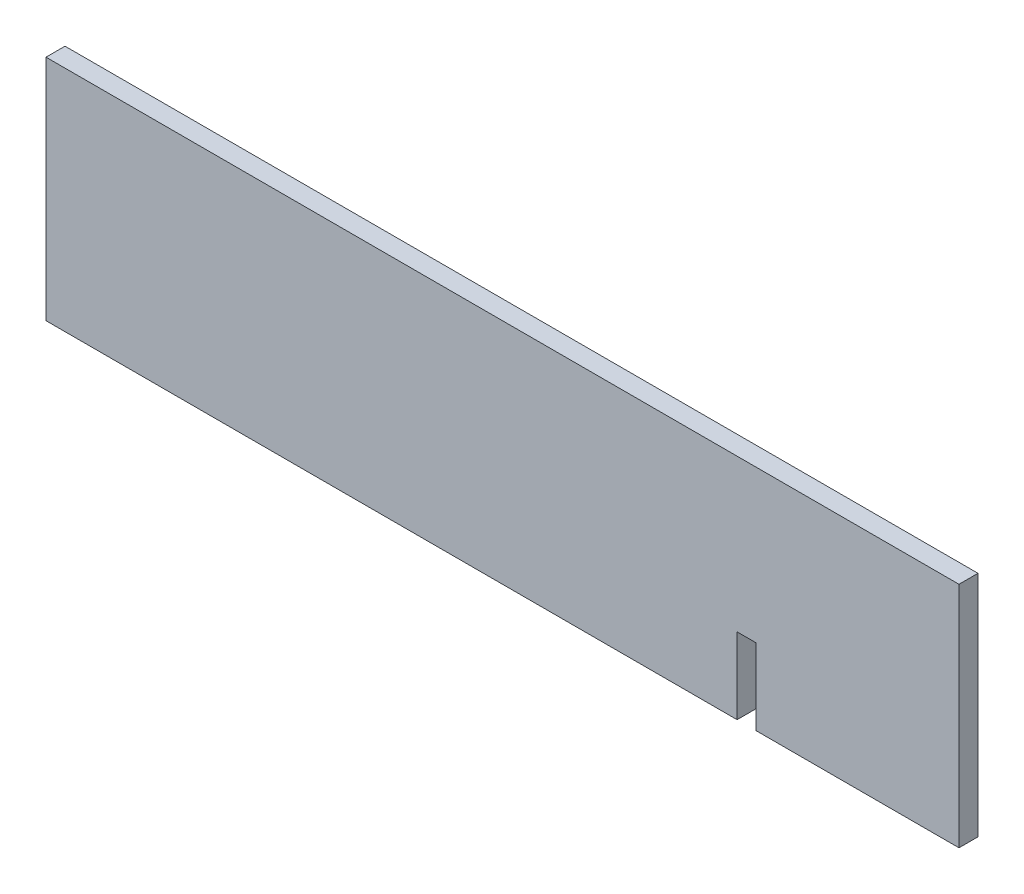
ISO-10303-21;
HEADER;
FILE_DESCRIPTION(('STEP AP214'),'2;1');
FILE_NAME('part.step','',(''),(''),'','','');
FILE_SCHEMA(('AUTOMOTIVE_DESIGN { 1 0 10303 214 1 1 1 1 }'));
ENDSEC;
DATA;
#1=APPLICATION_CONTEXT('core data for automotive mechanical design processes');
#2=APPLICATION_PROTOCOL_DEFINITION('international standard','automotive_design',2000,#1);
#3=PRODUCT_CONTEXT('',#1,'mechanical');
#4=PRODUCT('Part','Part','',(#3));
#5=PRODUCT_RELATED_PRODUCT_CATEGORY('part','',(#4));
#6=PRODUCT_DEFINITION_FORMATION('','',#4);
#7=PRODUCT_DEFINITION_CONTEXT('part definition',#1,'design');
#8=PRODUCT_DEFINITION('design','',#6,#7);
#9=PRODUCT_DEFINITION_SHAPE('','',#8);
#10=(LENGTH_UNIT() NAMED_UNIT(*) SI_UNIT(.MILLI.,.METRE.));
#11=(NAMED_UNIT(*) PLANE_ANGLE_UNIT() SI_UNIT($,.RADIAN.));
#12=(NAMED_UNIT(*) SI_UNIT($,.STERADIAN.) SOLID_ANGLE_UNIT());
#13=UNCERTAINTY_MEASURE_WITH_UNIT(LENGTH_MEASURE(1.E-05),#10,'distance_accuracy_value','');
#14=(GEOMETRIC_REPRESENTATION_CONTEXT(3) GLOBAL_UNCERTAINTY_ASSIGNED_CONTEXT((#13)) GLOBAL_UNIT_ASSIGNED_CONTEXT((#10,
#11,#12)) REPRESENTATION_CONTEXT('',''));
#15=CARTESIAN_POINT('',(0.,0.,0.));
#16=DIRECTION('',(0.,0.,1.));
#17=DIRECTION('',(1.,0.,0.));
#18=AXIS2_PLACEMENT_3D('',#15,#16,#17);
#19=CARTESIAN_POINT('',(-395.555057622941,0.,38.1));
#20=DIRECTION('',(0.,-1.,0.));
#21=DIRECTION('',(0.,0.,-1.));
#22=AXIS2_PLACEMENT_3D('',#19,#20,#21);
#23=PLANE('',#22);
#24=DIRECTION('',(0.,0.,-1.));
#25=VECTOR('',#24,1.);
#26=CARTESIAN_POINT('',(-444.5,0.,19.05));
#27=LINE('',#26,#25);
#28=CARTESIAN_POINT('',(-444.5,0.,38.1));
#29=VERTEX_POINT('',#28);
#30=CARTESIAN_POINT('',(-444.5,0.,0.));
#31=VERTEX_POINT('',#30);
#32=EDGE_CURVE('E205',#29,#31,#27,.T.);
#33=ORIENTED_EDGE('',*,*,#32,.F.);
#34=DIRECTION('',(-1.,0.,0.));
#35=VECTOR('',#34,1.);
#36=CARTESIAN_POINT('',(-395.555057622941,0.,38.1));
#37=LINE('',#36,#35);
#38=CARTESIAN_POINT('',(-1828.8,-1.66533453693773E-13,38.1));
#39=VERTEX_POINT('',#38);
#40=EDGE_CURVE('E52',#29,#39,#37,.T.);
#41=ORIENTED_EDGE('',*,*,#40,.T.);
#42=DIRECTION('',(0.,0.,-1.));
#43=VECTOR('',#42,1.);
#44=CARTESIAN_POINT('',(-1828.8,-1.66533453693773E-13,38.1));
#45=LINE('',#44,#43);
#46=CARTESIAN_POINT('',(-1828.8,-1.66533453693773E-13,0.));
#47=VERTEX_POINT('',#46);
#48=EDGE_CURVE('E158',#39,#47,#45,.T.);
#49=ORIENTED_EDGE('',*,*,#48,.T.);
#50=DIRECTION('',(-1.,0.,0.));
#51=VECTOR('',#50,1.);
#52=CARTESIAN_POINT('',(-395.555057622941,0.,0.));
#53=LINE('',#52,#51);
#54=EDGE_CURVE('E79',#31,#47,#53,.T.);
#55=ORIENTED_EDGE('',*,*,#54,.F.);
#56=EDGE_LOOP('',(#33,#41,#49,#55));
#57=FACE_BOUND('',#56,.T.);
#58=ADVANCED_FACE('F18',(#57),#23,.T.);
#59=CARTESIAN_POINT('',(-914.4,228.6,38.1));
#60=DIRECTION('',(0.,0.,1.));
#61=DIRECTION('',(1.,0.,0.));
#62=AXIS2_PLACEMENT_3D('',#59,#60,#61);
#63=PLANE('',#62);
#64=DIRECTION('',(-1.,0.,0.));
#65=VECTOR('',#64,1.);
#66=CARTESIAN_POINT('',(-395.555057622941,152.4,38.1));
#67=LINE('',#66,#65);
#68=CARTESIAN_POINT('',(-406.4,152.4,38.1));
#69=VERTEX_POINT('',#68);
#70=CARTESIAN_POINT('',(-444.5,152.4,38.1));
#71=VERTEX_POINT('',#70);
#72=EDGE_CURVE('E121',#69,#71,#67,.T.);
#73=ORIENTED_EDGE('',*,*,#72,.F.);
#74=DIRECTION('',(0.,-1.,0.));
#75=VECTOR('',#74,1.);
#76=CARTESIAN_POINT('',(-406.4,152.4,38.1));
#77=LINE('',#76,#75);
#78=CARTESIAN_POINT('',(-406.4,0.,38.1));
#79=VERTEX_POINT('',#78);
#80=EDGE_CURVE('E215',#69,#79,#77,.T.);
#81=ORIENTED_EDGE('',*,*,#80,.T.);
#82=CARTESIAN_POINT('',(0.,0.,38.1));
#83=VERTEX_POINT('',#82);
#84=EDGE_CURVE('E146',#83,#79,#37,.T.);
#85=ORIENTED_EDGE('',*,*,#84,.F.);
#86=DIRECTION('',(0.,1.,0.));
#87=VECTOR('',#86,1.);
#88=CARTESIAN_POINT('',(0.,228.6,38.1));
#89=LINE('',#88,#87);
#90=CARTESIAN_POINT('',(0.,457.2,38.1));
#91=VERTEX_POINT('',#90);
#92=EDGE_CURVE('E149',#83,#91,#89,.T.);
#93=ORIENTED_EDGE('',*,*,#92,.T.);
#94=DIRECTION('',(-1.,0.,0.));
#95=VECTOR('',#94,1.);
#96=CARTESIAN_POINT('',(-395.555057622941,457.2,38.1));
#97=LINE('',#96,#95);
#98=CARTESIAN_POINT('',(-1828.8,457.2,38.1));
#99=VERTEX_POINT('',#98);
#100=EDGE_CURVE('E152',#91,#99,#97,.T.);
#101=ORIENTED_EDGE('',*,*,#100,.T.);
#102=DIRECTION('',(0.,1.,0.));
#103=VECTOR('',#102,1.);
#104=CARTESIAN_POINT('',(-1828.8,228.6,38.1));
#105=LINE('',#104,#103);
#106=EDGE_CURVE('E155',#39,#99,#105,.T.);
#107=ORIENTED_EDGE('',*,*,#106,.F.);
#108=ORIENTED_EDGE('',*,*,#40,.F.);
#109=DIRECTION('',(0.,-1.,0.));
#110=VECTOR('',#109,1.);
#111=CARTESIAN_POINT('',(-444.5,152.4,38.1));
#112=LINE('',#111,#110);
#113=EDGE_CURVE('E116',#71,#29,#112,.T.);
#114=ORIENTED_EDGE('',*,*,#113,.F.);
#115=EDGE_LOOP('',(#73,#81,#85,#93,#101,#107,#108,#114));
#116=FACE_BOUND('',#115,.T.);
#117=ADVANCED_FACE('F133',(#116),#63,.T.);
#118=DIRECTION('',(0.,0.,1.));
#119=VECTOR('',#118,1.);
#120=CARTESIAN_POINT('',(-406.4,0.,19.05));
#121=LINE('',#120,#119);
#122=CARTESIAN_POINT('',(-406.4,0.,0.));
#123=VERTEX_POINT('',#122);
#124=EDGE_CURVE('E131',#123,#79,#121,.T.);
#125=ORIENTED_EDGE('',*,*,#124,.F.);
#126=CARTESIAN_POINT('',(0.,0.,0.));
#127=VERTEX_POINT('',#126);
#128=EDGE_CURVE('E140',#127,#123,#53,.T.);
#129=ORIENTED_EDGE('',*,*,#128,.F.);
#130=DIRECTION('',(0.,0.,-1.));
#131=VECTOR('',#130,1.);
#132=CARTESIAN_POINT('',(0.,0.,38.1));
#133=LINE('',#132,#131);
#134=EDGE_CURVE('E11',#83,#127,#133,.T.);
#135=ORIENTED_EDGE('',*,*,#134,.F.);
#136=ORIENTED_EDGE('',*,*,#84,.T.);
#137=EDGE_LOOP('',(#125,#129,#135,#136));
#138=FACE_BOUND('',#137,.T.);
#139=ADVANCED_FACE('F20',(#138),#23,.T.);
#140=CARTESIAN_POINT('',(0.,228.6,38.1));
#141=DIRECTION('',(-1.,0.,0.));
#142=DIRECTION('',(0.,0.,1.));
#143=AXIS2_PLACEMENT_3D('',#140,#141,#142);
#144=PLANE('',#143);
#145=DIRECTION('',(0.,1.,0.));
#146=VECTOR('',#145,1.);
#147=CARTESIAN_POINT('',(0.,228.6,0.));
#148=LINE('',#147,#146);
#149=CARTESIAN_POINT('',(0.,457.2,0.));
#150=VERTEX_POINT('',#149);
#151=EDGE_CURVE('E162',#127,#150,#148,.T.);
#152=ORIENTED_EDGE('',*,*,#151,.T.);
#153=DIRECTION('',(0.,0.,-1.));
#154=VECTOR('',#153,1.);
#155=CARTESIAN_POINT('',(0.,457.2,38.1));
#156=LINE('',#155,#154);
#157=EDGE_CURVE('E27',#91,#150,#156,.T.);
#158=ORIENTED_EDGE('',*,*,#157,.F.);
#159=ORIENTED_EDGE('',*,*,#92,.F.);
#160=ORIENTED_EDGE('',*,*,#134,.T.);
#161=EDGE_LOOP('',(#152,#158,#159,#160));
#162=FACE_BOUND('',#161,.T.);
#163=ADVANCED_FACE('F192',(#162),#144,.F.);
#164=CARTESIAN_POINT('',(-395.555057622941,457.2,38.1));
#165=DIRECTION('',(0.,-1.,0.));
#166=DIRECTION('',(0.,0.,-1.));
#167=AXIS2_PLACEMENT_3D('',#164,#165,#166);
#168=PLANE('',#167);
#169=DIRECTION('',(-1.,0.,0.));
#170=VECTOR('',#169,1.);
#171=CARTESIAN_POINT('',(-395.555057622941,457.2,0.));
#172=LINE('',#171,#170);
#173=CARTESIAN_POINT('',(-1828.8,457.2,0.));
#174=VERTEX_POINT('',#173);
#175=EDGE_CURVE('E165',#150,#174,#172,.T.);
#176=ORIENTED_EDGE('',*,*,#175,.T.);
#177=DIRECTION('',(0.,0.,-1.));
#178=VECTOR('',#177,1.);
#179=CARTESIAN_POINT('',(-1828.8,457.2,38.1));
#180=LINE('',#179,#178);
#181=EDGE_CURVE('E174',#99,#174,#180,.T.);
#182=ORIENTED_EDGE('',*,*,#181,.F.);
#183=ORIENTED_EDGE('',*,*,#100,.F.);
#184=ORIENTED_EDGE('',*,*,#157,.T.);
#185=EDGE_LOOP('',(#176,#182,#183,#184));
#186=FACE_BOUND('',#185,.T.);
#187=ADVANCED_FACE('F183',(#186),#168,.F.);
#188=CARTESIAN_POINT('',(-1828.8,228.6,38.1));
#189=DIRECTION('',(-1.,0.,0.));
#190=DIRECTION('',(0.,-1.,0.));
#191=AXIS2_PLACEMENT_3D('',#188,#189,#190);
#192=PLANE('',#191);
#193=DIRECTION('',(0.,1.,0.));
#194=VECTOR('',#193,1.);
#195=CARTESIAN_POINT('',(-1828.8,228.6,0.));
#196=LINE('',#195,#194);
#197=EDGE_CURVE('E169',#47,#174,#196,.T.);
#198=ORIENTED_EDGE('',*,*,#197,.F.);
#199=ORIENTED_EDGE('',*,*,#48,.F.);
#200=ORIENTED_EDGE('',*,*,#106,.T.);
#201=ORIENTED_EDGE('',*,*,#181,.T.);
#202=EDGE_LOOP('',(#198,#199,#200,#201));
#203=FACE_BOUND('',#202,.T.);
#204=ADVANCED_FACE('F190',(#203),#192,.T.);
#205=CARTESIAN_POINT('',(-914.4,228.6,0.));
#206=DIRECTION('',(0.,0.,1.));
#207=DIRECTION('',(1.,0.,0.));
#208=AXIS2_PLACEMENT_3D('',#205,#206,#207);
#209=PLANE('',#208);
#210=DIRECTION('',(-1.,0.,0.));
#211=VECTOR('',#210,1.);
#212=CARTESIAN_POINT('',(-395.555057622941,152.4,0.));
#213=LINE('',#212,#211);
#214=CARTESIAN_POINT('',(-406.4,152.4,0.));
#215=VERTEX_POINT('',#214);
#216=CARTESIAN_POINT('',(-444.5,152.4,0.));
#217=VERTEX_POINT('',#216);
#218=EDGE_CURVE('E120',#215,#217,#213,.T.);
#219=ORIENTED_EDGE('',*,*,#218,.T.);
#220=DIRECTION('',(0.,-1.,0.));
#221=VECTOR('',#220,1.);
#222=CARTESIAN_POINT('',(-444.5,152.4,0.));
#223=LINE('',#222,#221);
#224=EDGE_CURVE('E117',#217,#31,#223,.T.);
#225=ORIENTED_EDGE('',*,*,#224,.T.);
#226=ORIENTED_EDGE('',*,*,#54,.T.);
#227=ORIENTED_EDGE('',*,*,#197,.T.);
#228=ORIENTED_EDGE('',*,*,#175,.F.);
#229=ORIENTED_EDGE('',*,*,#151,.F.);
#230=ORIENTED_EDGE('',*,*,#128,.T.);
#231=DIRECTION('',(0.,-1.,0.));
#232=VECTOR('',#231,1.);
#233=CARTESIAN_POINT('',(-406.4,152.4,0.));
#234=LINE('',#233,#232);
#235=EDGE_CURVE('E142',#215,#123,#234,.T.);
#236=ORIENTED_EDGE('',*,*,#235,.F.);
#237=EDGE_LOOP('',(#219,#225,#226,#227,#228,#229,#230,#236));
#238=FACE_BOUND('',#237,.T.);
#239=ADVANCED_FACE('F187',(#238),#209,.F.);
#240=CARTESIAN_POINT('',(-444.5,152.4,19.05));
#241=DIRECTION('',(-1.,0.,0.));
#242=DIRECTION('',(0.,0.,1.));
#243=AXIS2_PLACEMENT_3D('',#240,#241,#242);
#244=PLANE('',#243);
#245=ORIENTED_EDGE('',*,*,#32,.T.);
#246=ORIENTED_EDGE('',*,*,#224,.F.);
#247=DIRECTION('',(0.,0.,-1.));
#248=VECTOR('',#247,1.);
#249=CARTESIAN_POINT('',(-444.5,152.4,19.05));
#250=LINE('',#249,#248);
#251=EDGE_CURVE('E39',#71,#217,#250,.T.);
#252=ORIENTED_EDGE('',*,*,#251,.F.);
#253=ORIENTED_EDGE('',*,*,#113,.T.);
#254=EDGE_LOOP('',(#245,#246,#252,#253));
#255=FACE_BOUND('',#254,.T.);
#256=ADVANCED_FACE('F114',(#255),#244,.F.);
#257=CARTESIAN_POINT('',(-406.4,152.4,19.05));
#258=DIRECTION('',(1.,0.,0.));
#259=DIRECTION('',(0.,0.,-1.));
#260=AXIS2_PLACEMENT_3D('',#257,#258,#259);
#261=PLANE('',#260);
#262=ORIENTED_EDGE('',*,*,#124,.T.);
#263=ORIENTED_EDGE('',*,*,#80,.F.);
#264=DIRECTION('',(0.,0.,1.));
#265=VECTOR('',#264,1.);
#266=CARTESIAN_POINT('',(-406.4,152.4,19.05));
#267=LINE('',#266,#265);
#268=EDGE_CURVE('E127',#215,#69,#267,.T.);
#269=ORIENTED_EDGE('',*,*,#268,.F.);
#270=ORIENTED_EDGE('',*,*,#235,.T.);
#271=EDGE_LOOP('',(#262,#263,#269,#270));
#272=FACE_BOUND('',#271,.T.);
#273=ADVANCED_FACE('F221',(#272),#261,.F.);
#274=CARTESIAN_POINT('',(-914.4,152.4,19.05));
#275=DIRECTION('',(0.,-1.,0.));
#276=DIRECTION('',(1.,0.,0.));
#277=AXIS2_PLACEMENT_3D('',#274,#275,#276);
#278=PLANE('',#277);
#279=ORIENTED_EDGE('',*,*,#72,.T.);
#280=ORIENTED_EDGE('',*,*,#251,.T.);
#281=ORIENTED_EDGE('',*,*,#218,.F.);
#282=ORIENTED_EDGE('',*,*,#268,.T.);
#283=EDGE_LOOP('',(#279,#280,#281,#282));
#284=FACE_BOUND('',#283,.T.);
#285=ADVANCED_FACE('F125',(#284),#278,.T.);
#286=CLOSED_SHELL('',(#58,#117,#139,#163,#187,#204,#239,#256,#273,#285));
#287=MANIFOLD_SOLID_BREP('B1',#286);
#288=ADVANCED_BREP_SHAPE_REPRESENTATION('',(#18,#287),#14);
#289=SHAPE_DEFINITION_REPRESENTATION(#9,#288);
ENDSEC;
END-ISO-10303-21;
